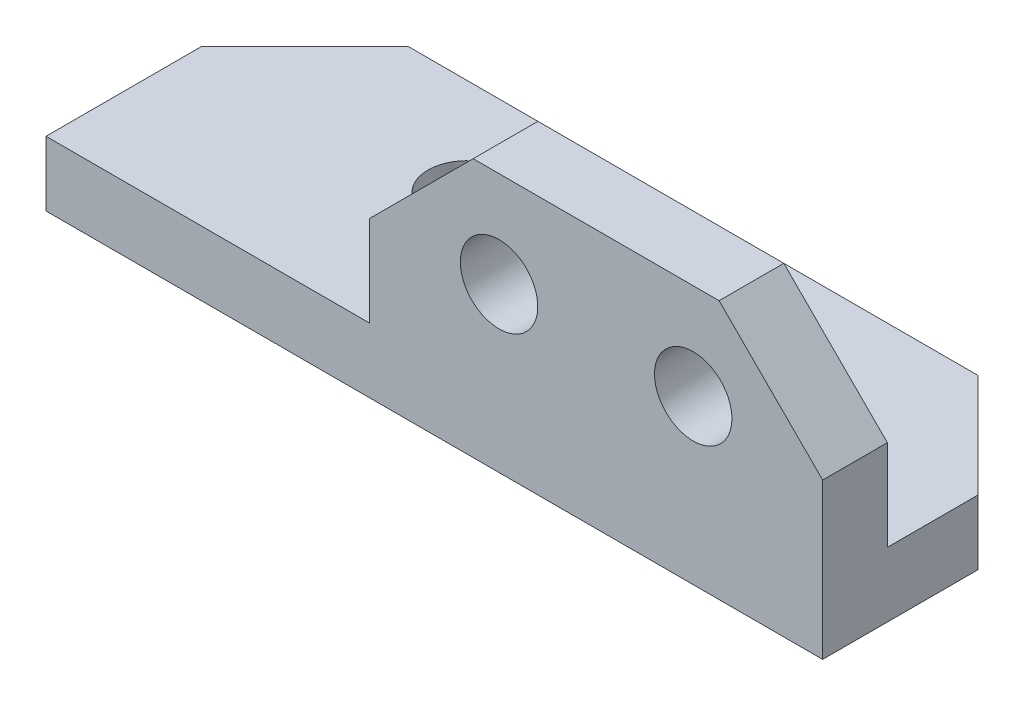
ISO-10303-21;
HEADER;
FILE_DESCRIPTION(('STEP AP214'),'2;1');
FILE_NAME('part.step','',(''),(''),'','','');
FILE_SCHEMA(('AUTOMOTIVE_DESIGN { 1 0 10303 214 1 1 1 1 }'));
ENDSEC;
DATA;
#1=APPLICATION_CONTEXT('core data for automotive mechanical design processes');
#2=APPLICATION_PROTOCOL_DEFINITION('international standard','automotive_design',2000,#1);
#3=PRODUCT_CONTEXT('',#1,'mechanical');
#4=PRODUCT('Part','Part','',(#3));
#5=PRODUCT_RELATED_PRODUCT_CATEGORY('part','',(#4));
#6=PRODUCT_DEFINITION_FORMATION('','',#4);
#7=PRODUCT_DEFINITION_CONTEXT('part definition',#1,'design');
#8=PRODUCT_DEFINITION('design','',#6,#7);
#9=PRODUCT_DEFINITION_SHAPE('','',#8);
#10=(LENGTH_UNIT() NAMED_UNIT(*) SI_UNIT(.MILLI.,.METRE.));
#11=(NAMED_UNIT(*) PLANE_ANGLE_UNIT() SI_UNIT($,.RADIAN.));
#12=(NAMED_UNIT(*) SI_UNIT($,.STERADIAN.) SOLID_ANGLE_UNIT());
#13=UNCERTAINTY_MEASURE_WITH_UNIT(LENGTH_MEASURE(1.E-05),#10,'distance_accuracy_value','');
#14=(GEOMETRIC_REPRESENTATION_CONTEXT(3) GLOBAL_UNCERTAINTY_ASSIGNED_CONTEXT((#13)) GLOBAL_UNIT_ASSIGNED_CONTEXT((#10,
#11,#12)) REPRESENTATION_CONTEXT('',''));
#15=CARTESIAN_POINT('',(0.,0.,0.));
#16=DIRECTION('',(0.,0.,1.));
#17=DIRECTION('',(1.,0.,0.));
#18=AXIS2_PLACEMENT_3D('',#15,#16,#17);
#19=CARTESIAN_POINT('',(19.05,9.525,0.));
#20=DIRECTION('',(0.,-1.,0.));
#21=DIRECTION('',(0.,0.,-1.));
#22=AXIS2_PLACEMENT_3D('',#19,#20,#21);
#23=PLANE('',#22);
#24=DIRECTION('',(-1.,0.,0.));
#25=VECTOR('',#24,1.);
#26=CARTESIAN_POINT('',(19.05,9.525,3.175));
#27=LINE('',#26,#25);
#28=CARTESIAN_POINT('',(13.97,9.525,3.175));
#29=VERTEX_POINT('',#28);
#30=CARTESIAN_POINT('',(1.90500000000003,9.525,3.175));
#31=VERTEX_POINT('',#30);
#32=EDGE_CURVE('E151',#29,#31,#27,.T.);
#33=ORIENTED_EDGE('',*,*,#32,.F.);
#34=DIRECTION('',(0.,0.,-1.));
#35=VECTOR('',#34,1.);
#36=CARTESIAN_POINT('',(13.97,9.525,0.));
#37=LINE('',#36,#35);
#38=CARTESIAN_POINT('',(13.97,9.525,0.));
#39=VERTEX_POINT('',#38);
#40=EDGE_CURVE('E181',#29,#39,#37,.T.);
#41=ORIENTED_EDGE('',*,*,#40,.T.);
#42=DIRECTION('',(-1.,0.,0.));
#43=VECTOR('',#42,1.);
#44=CARTESIAN_POINT('',(19.05,9.525,0.));
#45=LINE('',#44,#43);
#46=CARTESIAN_POINT('',(1.90500000000003,9.525,0.));
#47=VERTEX_POINT('',#46);
#48=EDGE_CURVE('E139',#39,#47,#45,.T.);
#49=ORIENTED_EDGE('',*,*,#48,.T.);
#50=DIRECTION('',(0.,0.,1.));
#51=VECTOR('',#50,1.);
#52=CARTESIAN_POINT('',(1.90500000000002,9.525,0.));
#53=LINE('',#52,#51);
#54=EDGE_CURVE('E179',#47,#31,#53,.T.);
#55=ORIENTED_EDGE('',*,*,#54,.T.);
#56=EDGE_LOOP('',(#33,#41,#49,#55));
#57=FACE_BOUND('',#56,.T.);
#58=ADVANCED_FACE('F34',(#57),#23,.F.);
#59=CARTESIAN_POINT('',(19.05,9.525,3.175));
#60=DIRECTION('',(0.,0.,-1.));
#61=DIRECTION('',(0.,1.,0.));
#62=AXIS2_PLACEMENT_3D('',#59,#60,#61);
#63=PLANE('',#62);
#64=CARTESIAN_POINT('',(3.175,4.826,3.175));
#65=DIRECTION('',(0.,0.,-1.));
#66=DIRECTION('',(0.,1.,0.));
#67=AXIS2_PLACEMENT_3D('',#64,#65,#66);
#68=CIRCLE('',#67,1.89865);
#69=CARTESIAN_POINT('',(3.175,6.72465,3.175));
#70=VERTEX_POINT('',#69);
#71=EDGE_CURVE('E218',#70,#70,#68,.T.);
#72=ORIENTED_EDGE('',*,*,#71,.T.);
#73=EDGE_LOOP('',(#72));
#74=FACE_BOUND('',#73,.T.);
#75=CARTESIAN_POINT('',(12.7,4.826,3.175));
#76=DIRECTION('',(0.,0.,-1.));
#77=DIRECTION('',(0.,1.,0.));
#78=AXIS2_PLACEMENT_3D('',#75,#76,#77);
#79=CIRCLE('',#78,1.89865);
#80=CARTESIAN_POINT('',(12.7,6.72465,3.175));
#81=VERTEX_POINT('',#80);
#82=EDGE_CURVE('E224',#81,#81,#79,.T.);
#83=ORIENTED_EDGE('',*,*,#82,.T.);
#84=EDGE_LOOP('',(#83));
#85=FACE_BOUND('',#84,.T.);
#86=DIRECTION('',(0.,-1.,0.));
#87=VECTOR('',#86,1.);
#88=CARTESIAN_POINT('',(19.05,9.525,3.175));
#89=LINE('',#88,#87);
#90=CARTESIAN_POINT('',(19.05,4.445,3.175));
#91=VERTEX_POINT('',#90);
#92=CARTESIAN_POINT('',(19.05,-3.175,3.175));
#93=VERTEX_POINT('',#92);
#94=EDGE_CURVE('E198',#91,#93,#89,.T.);
#95=ORIENTED_EDGE('',*,*,#94,.F.);
#96=DIRECTION('',(0.707106781186549,-0.707106781186546,0.));
#97=VECTOR('',#96,1.);
#98=CARTESIAN_POINT('',(19.05,4.445,3.175));
#99=LINE('',#98,#97);
#100=EDGE_CURVE('E177',#91,#29,#99,.F.);
#101=ORIENTED_EDGE('',*,*,#100,.T.);
#102=ORIENTED_EDGE('',*,*,#32,.T.);
#103=DIRECTION('',(0.707106781186549,0.707106781186546,0.));
#104=VECTOR('',#103,1.);
#105=CARTESIAN_POINT('',(-3.175,4.445,3.175));
#106=LINE('',#105,#104);
#107=CARTESIAN_POINT('',(-3.175,4.445,3.175));
#108=VERTEX_POINT('',#107);
#109=EDGE_CURVE('E175',#31,#108,#106,.F.);
#110=ORIENTED_EDGE('',*,*,#109,.T.);
#111=DIRECTION('',(0.,-1.,0.));
#112=VECTOR('',#111,1.);
#113=CARTESIAN_POINT('',(-3.175,9.525,3.175));
#114=LINE('',#113,#112);
#115=CARTESIAN_POINT('',(-3.175,0.,3.175));
#116=VERTEX_POINT('',#115);
#117=EDGE_CURVE('E122',#108,#116,#114,.T.);
#118=ORIENTED_EDGE('',*,*,#117,.T.);
#119=DIRECTION('',(-1.,0.,0.));
#120=VECTOR('',#119,1.);
#121=CARTESIAN_POINT('',(-3.175,0.,3.175));
#122=LINE('',#121,#120);
#123=CARTESIAN_POINT('',(-19.05,0.,3.175));
#124=VERTEX_POINT('',#123);
#125=EDGE_CURVE('E132',#116,#124,#122,.T.);
#126=ORIENTED_EDGE('',*,*,#125,.T.);
#127=DIRECTION('',(0.,-1.,0.));
#128=VECTOR('',#127,1.);
#129=CARTESIAN_POINT('',(-19.05,9.525,3.175));
#130=LINE('',#129,#128);
#131=CARTESIAN_POINT('',(-19.05,-3.175,3.175));
#132=VERTEX_POINT('',#131);
#133=EDGE_CURVE('E227',#124,#132,#130,.T.);
#134=ORIENTED_EDGE('',*,*,#133,.T.);
#135=DIRECTION('',(-1.,0.,0.));
#136=VECTOR('',#135,1.);
#137=CARTESIAN_POINT('',(19.05,-3.175,3.175));
#138=LINE('',#137,#136);
#139=EDGE_CURVE('E148',#93,#132,#138,.T.);
#140=ORIENTED_EDGE('',*,*,#139,.F.);
#141=EDGE_LOOP('',(#95,#101,#102,#110,#118,#126,#134,#140));
#142=FACE_BOUND('',#141,.T.);
#143=ADVANCED_FACE('F195',(#74,#85,#142),#63,.F.);
#144=CARTESIAN_POINT('',(19.05,-3.175,3.175));
#145=DIRECTION('',(0.,1.,0.));
#146=DIRECTION('',(0.,0.,1.));
#147=AXIS2_PLACEMENT_3D('',#144,#145,#146);
#148=PLANE('',#147);
#149=CARTESIAN_POINT('',(6.35,-3.175,-4.7625));
#150=DIRECTION('',(0.,1.,0.));
#151=DIRECTION('',(0.,0.,1.));
#152=AXIS2_PLACEMENT_3D('',#149,#150,#151);
#153=CIRCLE('',#152,1.89865);
#154=CARTESIAN_POINT('',(6.35,-3.175,-2.86385));
#155=VERTEX_POINT('',#154);
#156=EDGE_CURVE('E206',#155,#155,#153,.T.);
#157=ORIENTED_EDGE('',*,*,#156,.T.);
#158=EDGE_LOOP('',(#157));
#159=FACE_BOUND('',#158,.T.);
#160=CARTESIAN_POINT('',(-6.35,-3.175,-4.7625));
#161=DIRECTION('',(0.,1.,0.));
#162=DIRECTION('',(0.,0.,1.));
#163=AXIS2_PLACEMENT_3D('',#160,#161,#162);
#164=CIRCLE('',#163,1.89865);
#165=CARTESIAN_POINT('',(-6.35,-3.175,-2.86385));
#166=VERTEX_POINT('',#165);
#167=EDGE_CURVE('E212',#166,#166,#164,.T.);
#168=ORIENTED_EDGE('',*,*,#167,.T.);
#169=EDGE_LOOP('',(#168));
#170=FACE_BOUND('',#169,.T.);
#171=DIRECTION('',(0.,0.,-1.));
#172=VECTOR('',#171,1.);
#173=CARTESIAN_POINT('',(-19.05,-3.175,3.175));
#174=LINE('',#173,#172);
#175=CARTESIAN_POINT('',(-19.05,-3.175,-4.44499999999999));
#176=VERTEX_POINT('',#175);
#177=EDGE_CURVE('E229',#132,#176,#174,.T.);
#178=ORIENTED_EDGE('',*,*,#177,.T.);
#179=DIRECTION('',(0.707106781186546,0.,-0.707106781186549));
#180=VECTOR('',#179,1.);
#181=CARTESIAN_POINT('',(-13.97,-3.175,-9.525));
#182=LINE('',#181,#180);
#183=CARTESIAN_POINT('',(-13.97,-3.175,-9.525));
#184=VERTEX_POINT('',#183);
#185=EDGE_CURVE('E167',#176,#184,#182,.T.);
#186=ORIENTED_EDGE('',*,*,#185,.T.);
#187=DIRECTION('',(-1.,0.,0.));
#188=VECTOR('',#187,1.);
#189=CARTESIAN_POINT('',(19.05,-3.175,-9.525));
#190=LINE('',#189,#188);
#191=CARTESIAN_POINT('',(13.97,-3.175,-9.525));
#192=VERTEX_POINT('',#191);
#193=EDGE_CURVE('E141',#192,#184,#190,.T.);
#194=ORIENTED_EDGE('',*,*,#193,.F.);
#195=DIRECTION('',(-0.707106781186549,0.,-0.707106781186546));
#196=VECTOR('',#195,1.);
#197=CARTESIAN_POINT('',(19.05,-3.175,-4.44500000000001));
#198=LINE('',#197,#196);
#199=CARTESIAN_POINT('',(19.05,-3.175,-4.44500000000001));
#200=VERTEX_POINT('',#199);
#201=EDGE_CURVE('E165',#192,#200,#198,.F.);
#202=ORIENTED_EDGE('',*,*,#201,.T.);
#203=DIRECTION('',(0.,0.,-1.));
#204=VECTOR('',#203,1.);
#205=CARTESIAN_POINT('',(19.05,-3.175,3.175));
#206=LINE('',#205,#204);
#207=EDGE_CURVE('E235',#93,#200,#206,.T.);
#208=ORIENTED_EDGE('',*,*,#207,.F.);
#209=ORIENTED_EDGE('',*,*,#139,.T.);
#210=EDGE_LOOP('',(#178,#186,#194,#202,#208,#209));
#211=FACE_BOUND('',#210,.T.);
#212=ADVANCED_FACE('F258',(#159,#170,#211),#148,.F.);
#213=CARTESIAN_POINT('',(19.05,-3.175,-9.525));
#214=DIRECTION('',(0.,0.,1.));
#215=DIRECTION('',(1.,0.,0.));
#216=AXIS2_PLACEMENT_3D('',#213,#214,#215);
#217=PLANE('',#216);
#218=ORIENTED_EDGE('',*,*,#193,.T.);
#219=DIRECTION('',(0.,1.,0.));
#220=VECTOR('',#219,1.);
#221=CARTESIAN_POINT('',(-13.97,0.,-9.525));
#222=LINE('',#221,#220);
#223=CARTESIAN_POINT('',(-13.97,0.,-9.525));
#224=VERTEX_POINT('',#223);
#225=EDGE_CURVE('E156',#184,#224,#222,.T.);
#226=ORIENTED_EDGE('',*,*,#225,.T.);
#227=DIRECTION('',(-1.,0.,0.));
#228=VECTOR('',#227,1.);
#229=CARTESIAN_POINT('',(19.05,0.,-9.525));
#230=LINE('',#229,#228);
#231=CARTESIAN_POINT('',(13.97,0.,-9.525));
#232=VERTEX_POINT('',#231);
#233=EDGE_CURVE('E138',#232,#224,#230,.T.);
#234=ORIENTED_EDGE('',*,*,#233,.F.);
#235=DIRECTION('',(0.,-1.,0.));
#236=VECTOR('',#235,1.);
#237=CARTESIAN_POINT('',(13.97,-3.175,-9.525));
#238=LINE('',#237,#236);
#239=EDGE_CURVE('E154',#232,#192,#238,.T.);
#240=ORIENTED_EDGE('',*,*,#239,.T.);
#241=EDGE_LOOP('',(#218,#226,#234,#240));
#242=FACE_BOUND('',#241,.T.);
#243=ADVANCED_FACE('F246',(#242),#217,.F.);
#244=CARTESIAN_POINT('',(19.05,0.,-9.525));
#245=DIRECTION('',(0.,-1.,0.));
#246=DIRECTION('',(0.,0.,-1.));
#247=AXIS2_PLACEMENT_3D('',#244,#245,#246);
#248=PLANE('',#247);
#249=CARTESIAN_POINT('',(6.35,0.,-4.7625));
#250=DIRECTION('',(0.,1.,0.));
#251=DIRECTION('',(0.,0.,1.));
#252=AXIS2_PLACEMENT_3D('',#249,#250,#251);
#253=CIRCLE('',#252,1.89865);
#254=CARTESIAN_POINT('',(6.35,0.,-2.86385));
#255=VERTEX_POINT('',#254);
#256=EDGE_CURVE('E133',#255,#255,#253,.T.);
#257=ORIENTED_EDGE('',*,*,#256,.F.);
#258=EDGE_LOOP('',(#257));
#259=FACE_BOUND('',#258,.T.);
#260=CARTESIAN_POINT('',(-6.35,0.,-4.7625));
#261=DIRECTION('',(0.,1.,0.));
#262=DIRECTION('',(0.,0.,1.));
#263=AXIS2_PLACEMENT_3D('',#260,#261,#262);
#264=CIRCLE('',#263,1.89865);
#265=CARTESIAN_POINT('',(-6.35,0.,-2.86385));
#266=VERTEX_POINT('',#265);
#267=EDGE_CURVE('E209',#266,#266,#264,.T.);
#268=ORIENTED_EDGE('',*,*,#267,.F.);
#269=EDGE_LOOP('',(#268));
#270=FACE_BOUND('',#269,.T.);
#271=ORIENTED_EDGE('',*,*,#233,.T.);
#272=DIRECTION('',(-0.707106781186546,0.,0.707106781186549));
#273=VECTOR('',#272,1.);
#274=CARTESIAN_POINT('',(-13.97,0.,-9.525));
#275=LINE('',#274,#273);
#276=CARTESIAN_POINT('',(-19.05,0.,-4.44499999999999));
#277=VERTEX_POINT('',#276);
#278=EDGE_CURVE('E161',#224,#277,#275,.T.);
#279=ORIENTED_EDGE('',*,*,#278,.T.);
#280=DIRECTION('',(0.,0.,1.));
#281=VECTOR('',#280,1.);
#282=CARTESIAN_POINT('',(-19.05,0.,-9.525));
#283=LINE('',#282,#281);
#284=EDGE_CURVE('E232',#277,#124,#283,.T.);
#285=ORIENTED_EDGE('',*,*,#284,.T.);
#286=ORIENTED_EDGE('',*,*,#125,.F.);
#287=DIRECTION('',(0.,0.,-1.));
#288=VECTOR('',#287,1.);
#289=CARTESIAN_POINT('',(-3.175,0.,3.175));
#290=LINE('',#289,#288);
#291=CARTESIAN_POINT('',(-3.175,0.,0.));
#292=VERTEX_POINT('',#291);
#293=EDGE_CURVE('E119',#116,#292,#290,.T.);
#294=ORIENTED_EDGE('',*,*,#293,.T.);
#295=DIRECTION('',(-1.,0.,0.));
#296=VECTOR('',#295,1.);
#297=CARTESIAN_POINT('',(19.05,0.,0.));
#298=LINE('',#297,#296);
#299=CARTESIAN_POINT('',(19.05,0.,0.));
#300=VERTEX_POINT('',#299);
#301=EDGE_CURVE('E129',#300,#292,#298,.T.);
#302=ORIENTED_EDGE('',*,*,#301,.F.);
#303=DIRECTION('',(0.,0.,1.));
#304=VECTOR('',#303,1.);
#305=CARTESIAN_POINT('',(19.05,0.,-9.525));
#306=LINE('',#305,#304);
#307=CARTESIAN_POINT('',(19.05,0.,-4.44500000000001));
#308=VERTEX_POINT('',#307);
#309=EDGE_CURVE('E191',#308,#300,#306,.T.);
#310=ORIENTED_EDGE('',*,*,#309,.F.);
#311=DIRECTION('',(0.707106781186549,0.,0.707106781186546));
#312=VECTOR('',#311,1.);
#313=CARTESIAN_POINT('',(19.05,0.,-4.44500000000001));
#314=LINE('',#313,#312);
#315=EDGE_CURVE('E159',#308,#232,#314,.F.);
#316=ORIENTED_EDGE('',*,*,#315,.T.);
#317=EDGE_LOOP('',(#271,#279,#285,#286,#294,#302,#310,#316));
#318=FACE_BOUND('',#317,.T.);
#319=ADVANCED_FACE('F127',(#259,#270,#318),#248,.F.);
#320=CARTESIAN_POINT('',(19.05,0.,0.));
#321=DIRECTION('',(0.,0.,1.));
#322=DIRECTION('',(1.,0.,0.));
#323=AXIS2_PLACEMENT_3D('',#320,#321,#322);
#324=PLANE('',#323);
#325=CARTESIAN_POINT('',(3.175,4.826,0.));
#326=DIRECTION('',(0.,0.,-1.));
#327=DIRECTION('',(-1.,0.,0.));
#328=AXIS2_PLACEMENT_3D('',#325,#326,#327);
#329=CIRCLE('',#328,1.89865);
#330=CARTESIAN_POINT('',(1.27635,4.826,0.));
#331=VERTEX_POINT('',#330);
#332=EDGE_CURVE('E215',#331,#331,#329,.T.);
#333=ORIENTED_EDGE('',*,*,#332,.F.);
#334=EDGE_LOOP('',(#333));
#335=FACE_BOUND('',#334,.T.);
#336=CARTESIAN_POINT('',(12.7,4.826,0.));
#337=DIRECTION('',(0.,0.,-1.));
#338=DIRECTION('',(-1.,0.,0.));
#339=AXIS2_PLACEMENT_3D('',#336,#337,#338);
#340=CIRCLE('',#339,1.89865);
#341=CARTESIAN_POINT('',(10.80135,4.826,0.));
#342=VERTEX_POINT('',#341);
#343=EDGE_CURVE('E221',#342,#342,#340,.T.);
#344=ORIENTED_EDGE('',*,*,#343,.F.);
#345=EDGE_LOOP('',(#344));
#346=FACE_BOUND('',#345,.T.);
#347=ORIENTED_EDGE('',*,*,#48,.F.);
#348=DIRECTION('',(-0.707106781186549,0.707106781186546,0.));
#349=VECTOR('',#348,1.);
#350=CARTESIAN_POINT('',(19.05,4.445,0.));
#351=LINE('',#350,#349);
#352=CARTESIAN_POINT('',(19.05,4.445,0.));
#353=VERTEX_POINT('',#352);
#354=EDGE_CURVE('E41',#39,#353,#351,.F.);
#355=ORIENTED_EDGE('',*,*,#354,.T.);
#356=DIRECTION('',(0.,1.,0.));
#357=VECTOR('',#356,1.);
#358=CARTESIAN_POINT('',(19.05,0.,0.));
#359=LINE('',#358,#357);
#360=EDGE_CURVE('E137',#300,#353,#359,.T.);
#361=ORIENTED_EDGE('',*,*,#360,.F.);
#362=ORIENTED_EDGE('',*,*,#301,.T.);
#363=DIRECTION('',(0.,-1.,0.));
#364=VECTOR('',#363,1.);
#365=CARTESIAN_POINT('',(-3.175,9.525,0.));
#366=LINE('',#365,#364);
#367=CARTESIAN_POINT('',(-3.175,4.445,0.));
#368=VERTEX_POINT('',#367);
#369=EDGE_CURVE('E115',#368,#292,#366,.T.);
#370=ORIENTED_EDGE('',*,*,#369,.F.);
#371=DIRECTION('',(-0.707106781186549,-0.707106781186546,0.));
#372=VECTOR('',#371,1.);
#373=CARTESIAN_POINT('',(-3.175,4.445,0.));
#374=LINE('',#373,#372);
#375=EDGE_CURVE('E48',#368,#47,#374,.F.);
#376=ORIENTED_EDGE('',*,*,#375,.T.);
#377=EDGE_LOOP('',(#347,#355,#361,#362,#370,#376));
#378=FACE_BOUND('',#377,.T.);
#379=ADVANCED_FACE('F135',(#335,#346,#378),#324,.F.);
#380=CARTESIAN_POINT('',(19.05,9.525,-9.525));
#381=DIRECTION('',(-1.,0.,0.));
#382=DIRECTION('',(0.,0.,1.));
#383=AXIS2_PLACEMENT_3D('',#380,#381,#382);
#384=PLANE('',#383);
#385=ORIENTED_EDGE('',*,*,#207,.T.);
#386=DIRECTION('',(0.,1.,0.));
#387=VECTOR('',#386,1.);
#388=CARTESIAN_POINT('',(19.05,9.525,-4.44500000000001));
#389=LINE('',#388,#387);
#390=EDGE_CURVE('E172',#200,#308,#389,.T.);
#391=ORIENTED_EDGE('',*,*,#390,.T.);
#392=ORIENTED_EDGE('',*,*,#309,.T.);
#393=ORIENTED_EDGE('',*,*,#360,.T.);
#394=DIRECTION('',(0.,0.,1.));
#395=VECTOR('',#394,1.);
#396=CARTESIAN_POINT('',(19.05,4.445,-9.525));
#397=LINE('',#396,#395);
#398=EDGE_CURVE('E169',#353,#91,#397,.T.);
#399=ORIENTED_EDGE('',*,*,#398,.T.);
#400=ORIENTED_EDGE('',*,*,#94,.T.);
#401=EDGE_LOOP('',(#385,#391,#392,#393,#399,#400));
#402=FACE_BOUND('',#401,.T.);
#403=ADVANCED_FACE('F189',(#402),#384,.F.);
#404=CARTESIAN_POINT('',(-19.05,9.525,-9.525));
#405=DIRECTION('',(-1.,0.,0.));
#406=DIRECTION('',(0.,0.,1.));
#407=AXIS2_PLACEMENT_3D('',#404,#405,#406);
#408=PLANE('',#407);
#409=ORIENTED_EDGE('',*,*,#284,.F.);
#410=DIRECTION('',(0.,-1.,0.));
#411=VECTOR('',#410,1.);
#412=CARTESIAN_POINT('',(-19.05,-3.175,-4.44499999999999));
#413=LINE('',#412,#411);
#414=EDGE_CURVE('E163',#277,#176,#413,.T.);
#415=ORIENTED_EDGE('',*,*,#414,.T.);
#416=ORIENTED_EDGE('',*,*,#177,.F.);
#417=ORIENTED_EDGE('',*,*,#133,.F.);
#418=EDGE_LOOP('',(#409,#415,#416,#417));
#419=FACE_BOUND('',#418,.T.);
#420=ADVANCED_FACE('F256',(#419),#408,.T.);
#421=CARTESIAN_POINT('',(12.7,4.826,0.));
#422=DIRECTION('',(0.,0.,-1.));
#423=DIRECTION('',(-1.,0.,0.));
#424=AXIS2_PLACEMENT_3D('',#421,#422,#423);
#425=CYLINDRICAL_SURFACE('',#424,1.89865);
#426=ORIENTED_EDGE('',*,*,#343,.T.);
#427=EDGE_LOOP('',(#426));
#428=FACE_BOUND('',#427,.T.);
#429=ORIENTED_EDGE('',*,*,#82,.F.);
#430=EDGE_LOOP('',(#429));
#431=FACE_BOUND('',#430,.T.);
#432=ADVANCED_FACE('F325',(#428,#431),#425,.F.);
#433=CARTESIAN_POINT('',(3.175,4.826,0.));
#434=DIRECTION('',(0.,0.,-1.));
#435=DIRECTION('',(-1.,0.,0.));
#436=AXIS2_PLACEMENT_3D('',#433,#434,#435);
#437=CYLINDRICAL_SURFACE('',#436,1.89865);
#438=ORIENTED_EDGE('',*,*,#332,.T.);
#439=EDGE_LOOP('',(#438));
#440=FACE_BOUND('',#439,.T.);
#441=ORIENTED_EDGE('',*,*,#71,.F.);
#442=EDGE_LOOP('',(#441));
#443=FACE_BOUND('',#442,.T.);
#444=ADVANCED_FACE('F378',(#440,#443),#437,.F.);
#445=CARTESIAN_POINT('',(-6.35,0.,-4.7625));
#446=DIRECTION('',(0.,1.,0.));
#447=DIRECTION('',(0.,0.,1.));
#448=AXIS2_PLACEMENT_3D('',#445,#446,#447);
#449=CYLINDRICAL_SURFACE('',#448,1.89865);
#450=ORIENTED_EDGE('',*,*,#267,.T.);
#451=EDGE_LOOP('',(#450));
#452=FACE_BOUND('',#451,.T.);
#453=ORIENTED_EDGE('',*,*,#167,.F.);
#454=EDGE_LOOP('',(#453));
#455=FACE_BOUND('',#454,.T.);
#456=ADVANCED_FACE('F374',(#452,#455),#449,.F.);
#457=CARTESIAN_POINT('',(6.35,0.,-4.7625));
#458=DIRECTION('',(0.,1.,0.));
#459=DIRECTION('',(0.,0.,1.));
#460=AXIS2_PLACEMENT_3D('',#457,#458,#459);
#461=CYLINDRICAL_SURFACE('',#460,1.89865);
#462=ORIENTED_EDGE('',*,*,#256,.T.);
#463=EDGE_LOOP('',(#462));
#464=FACE_BOUND('',#463,.T.);
#465=ORIENTED_EDGE('',*,*,#156,.F.);
#466=EDGE_LOOP('',(#465));
#467=FACE_BOUND('',#466,.T.);
#468=ADVANCED_FACE('F335',(#464,#467),#461,.F.);
#469=CARTESIAN_POINT('',(-3.175,9.525,3.175));
#470=DIRECTION('',(1.,0.,0.));
#471=DIRECTION('',(0.,1.,0.));
#472=AXIS2_PLACEMENT_3D('',#469,#470,#471);
#473=PLANE('',#472);
#474=ORIENTED_EDGE('',*,*,#117,.F.);
#475=DIRECTION('',(0.,0.,-1.));
#476=VECTOR('',#475,1.);
#477=CARTESIAN_POINT('',(-3.175,4.445,3.175));
#478=LINE('',#477,#476);
#479=EDGE_CURVE('E11',#108,#368,#478,.T.);
#480=ORIENTED_EDGE('',*,*,#479,.T.);
#481=ORIENTED_EDGE('',*,*,#369,.T.);
#482=ORIENTED_EDGE('',*,*,#293,.F.);
#483=EDGE_LOOP('',(#474,#480,#481,#482));
#484=FACE_BOUND('',#483,.T.);
#485=ADVANCED_FACE('F118',(#484),#473,.F.);
#486=CARTESIAN_POINT('',(-13.97,-3.175,-9.525));
#487=DIRECTION('',(-0.707106781186549,0.,-0.707106781186546));
#488=DIRECTION('',(-0.707106781186546,0.,0.707106781186549));
#489=AXIS2_PLACEMENT_3D('',#486,#487,#488);
#490=PLANE('',#489);
#491=ORIENTED_EDGE('',*,*,#185,.F.);
#492=ORIENTED_EDGE('',*,*,#414,.F.);
#493=ORIENTED_EDGE('',*,*,#278,.F.);
#494=ORIENTED_EDGE('',*,*,#225,.F.);
#495=EDGE_LOOP('',(#491,#492,#493,#494));
#496=FACE_BOUND('',#495,.T.);
#497=ADVANCED_FACE('F251',(#496),#490,.T.);
#498=CARTESIAN_POINT('',(19.05,9.525,-4.44500000000001));
#499=DIRECTION('',(-0.707106781186546,0.,0.707106781186549));
#500=DIRECTION('',(0.707106781186549,0.,0.707106781186546));
#501=AXIS2_PLACEMENT_3D('',#498,#499,#500);
#502=PLANE('',#501);
#503=ORIENTED_EDGE('',*,*,#201,.F.);
#504=ORIENTED_EDGE('',*,*,#239,.F.);
#505=ORIENTED_EDGE('',*,*,#315,.F.);
#506=ORIENTED_EDGE('',*,*,#390,.F.);
#507=EDGE_LOOP('',(#503,#504,#505,#506));
#508=FACE_BOUND('',#507,.T.);
#509=ADVANCED_FACE('F242',(#508),#502,.F.);
#510=CARTESIAN_POINT('',(19.05,4.445,-9.525));
#511=DIRECTION('',(-0.707106781186546,-0.707106781186549,0.));
#512=DIRECTION('',(0.707106781186549,-0.707106781186546,0.));
#513=AXIS2_PLACEMENT_3D('',#510,#511,#512);
#514=PLANE('',#513);
#515=ORIENTED_EDGE('',*,*,#354,.F.);
#516=ORIENTED_EDGE('',*,*,#40,.F.);
#517=ORIENTED_EDGE('',*,*,#100,.F.);
#518=ORIENTED_EDGE('',*,*,#398,.F.);
#519=EDGE_LOOP('',(#515,#516,#517,#518));
#520=FACE_BOUND('',#519,.T.);
#521=ADVANCED_FACE('F192',(#520),#514,.F.);
#522=CARTESIAN_POINT('',(-3.175,4.445,3.175));
#523=DIRECTION('',(0.707106781186546,-0.707106781186549,0.));
#524=DIRECTION('',(0.707106781186549,0.707106781186546,0.));
#525=AXIS2_PLACEMENT_3D('',#522,#523,#524);
#526=PLANE('',#525);
#527=ORIENTED_EDGE('',*,*,#109,.F.);
#528=ORIENTED_EDGE('',*,*,#54,.F.);
#529=ORIENTED_EDGE('',*,*,#375,.F.);
#530=ORIENTED_EDGE('',*,*,#479,.F.);
#531=EDGE_LOOP('',(#527,#528,#529,#530));
#532=FACE_BOUND('',#531,.T.);
#533=ADVANCED_FACE('F200',(#532),#526,.F.);
#534=CLOSED_SHELL('',(#58,#143,#212,#243,#319,#379,#403,#420,#432,#444,#456,#468,#485,#497,#509,
#521,#533));
#535=MANIFOLD_SOLID_BREP('B2',#534);
#536=ADVANCED_BREP_SHAPE_REPRESENTATION('',(#18,#535),#14);
#537=SHAPE_DEFINITION_REPRESENTATION(#9,#536);
ENDSEC;
END-ISO-10303-21;
